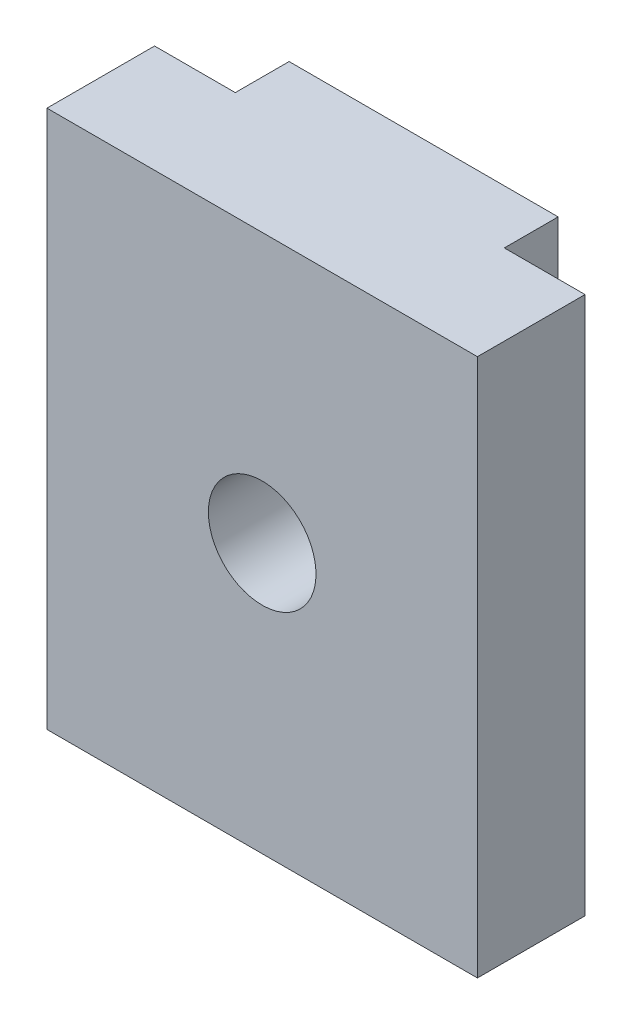
ISO-10303-21;
HEADER;
FILE_DESCRIPTION(('STEP AP214'),'2;1');
FILE_NAME('part.step','',(''),(''),'','','');
FILE_SCHEMA(('AUTOMOTIVE_DESIGN { 1 0 10303 214 1 1 1 1 }'));
ENDSEC;
DATA;
#1=APPLICATION_CONTEXT('core data for automotive mechanical design processes');
#2=APPLICATION_PROTOCOL_DEFINITION('international standard','automotive_design',2000,#1);
#3=PRODUCT_CONTEXT('',#1,'mechanical');
#4=PRODUCT('Part','Part','',(#3));
#5=PRODUCT_RELATED_PRODUCT_CATEGORY('part','',(#4));
#6=PRODUCT_DEFINITION_FORMATION('','',#4);
#7=PRODUCT_DEFINITION_CONTEXT('part definition',#1,'design');
#8=PRODUCT_DEFINITION('design','',#6,#7);
#9=PRODUCT_DEFINITION_SHAPE('','',#8);
#10=(LENGTH_UNIT() NAMED_UNIT(*) SI_UNIT(.MILLI.,.METRE.));
#11=(NAMED_UNIT(*) PLANE_ANGLE_UNIT() SI_UNIT($,.RADIAN.));
#12=(NAMED_UNIT(*) SI_UNIT($,.STERADIAN.) SOLID_ANGLE_UNIT());
#13=UNCERTAINTY_MEASURE_WITH_UNIT(LENGTH_MEASURE(1.E-05),#10,'distance_accuracy_value','');
#14=(GEOMETRIC_REPRESENTATION_CONTEXT(3) GLOBAL_UNCERTAINTY_ASSIGNED_CONTEXT((#13)) GLOBAL_UNIT_ASSIGNED_CONTEXT((#10,
#11,#12)) REPRESENTATION_CONTEXT('',''));
#15=CARTESIAN_POINT('',(0.,0.,0.));
#16=DIRECTION('',(0.,0.,1.));
#17=DIRECTION('',(1.,0.,0.));
#18=AXIS2_PLACEMENT_3D('',#15,#16,#17);
#19=CARTESIAN_POINT('',(7.99999999999999,20.,-2.));
#20=DIRECTION('',(-1.,0.,0.));
#21=DIRECTION('',(0.,0.,1.));
#22=AXIS2_PLACEMENT_3D('',#19,#20,#21);
#23=PLANE('',#22);
#24=DIRECTION('',(0.,0.,-1.));
#25=VECTOR('',#24,1.);
#26=CARTESIAN_POINT('',(7.99999999999999,0.,-2.));
#27=LINE('',#26,#25);
#28=CARTESIAN_POINT('',(7.99999999999999,0.,2.));
#29=VERTEX_POINT('',#28);
#30=CARTESIAN_POINT('',(7.99999999999999,0.,-2.));
#31=VERTEX_POINT('',#30);
#32=EDGE_CURVE('E128',#29,#31,#27,.T.);
#33=ORIENTED_EDGE('',*,*,#32,.T.);
#34=DIRECTION('',(0.,-1.,0.));
#35=VECTOR('',#34,1.);
#36=CARTESIAN_POINT('',(7.99999999999999,20.,-2.));
#37=LINE('',#36,#35);
#38=CARTESIAN_POINT('',(7.99999999999999,20.,-2.));
#39=VERTEX_POINT('',#38);
#40=EDGE_CURVE('E11',#39,#31,#37,.T.);
#41=ORIENTED_EDGE('',*,*,#40,.F.);
#42=DIRECTION('',(0.,0.,-1.));
#43=VECTOR('',#42,1.);
#44=CARTESIAN_POINT('',(7.99999999999999,20.,-2.));
#45=LINE('',#44,#43);
#46=CARTESIAN_POINT('',(7.99999999999999,20.,2.));
#47=VERTEX_POINT('',#46);
#48=EDGE_CURVE('E142',#47,#39,#45,.T.);
#49=ORIENTED_EDGE('',*,*,#48,.F.);
#50=DIRECTION('',(0.,-1.,0.));
#51=VECTOR('',#50,1.);
#52=CARTESIAN_POINT('',(7.99999999999999,20.,2.));
#53=LINE('',#52,#51);
#54=EDGE_CURVE('E124',#47,#29,#53,.T.);
#55=ORIENTED_EDGE('',*,*,#54,.T.);
#56=EDGE_LOOP('',(#33,#41,#49,#55));
#57=FACE_BOUND('',#56,.T.);
#58=ADVANCED_FACE('F31',(#57),#23,.F.);
#59=CARTESIAN_POINT('',(4.99999999999999,20.,-2.));
#60=DIRECTION('',(0.,0.,1.));
#61=DIRECTION('',(1.,0.,0.));
#62=AXIS2_PLACEMENT_3D('',#59,#60,#61);
#63=PLANE('',#62);
#64=DIRECTION('',(-1.,0.,0.));
#65=VECTOR('',#64,1.);
#66=CARTESIAN_POINT('',(4.99999999999999,0.,-2.));
#67=LINE('',#66,#65);
#68=CARTESIAN_POINT('',(4.99999999999999,0.,-2.));
#69=VERTEX_POINT('',#68);
#70=EDGE_CURVE('E131',#31,#69,#67,.T.);
#71=ORIENTED_EDGE('',*,*,#70,.T.);
#72=DIRECTION('',(0.,-1.,0.));
#73=VECTOR('',#72,1.);
#74=CARTESIAN_POINT('',(4.99999999999999,20.,-2.));
#75=LINE('',#74,#73);
#76=CARTESIAN_POINT('',(4.99999999999999,20.,-2.));
#77=VERTEX_POINT('',#76);
#78=EDGE_CURVE('E40',#77,#69,#75,.T.);
#79=ORIENTED_EDGE('',*,*,#78,.F.);
#80=DIRECTION('',(-1.,0.,0.));
#81=VECTOR('',#80,1.);
#82=CARTESIAN_POINT('',(4.99999999999999,20.,-2.));
#83=LINE('',#82,#81);
#84=EDGE_CURVE('E91',#39,#77,#83,.T.);
#85=ORIENTED_EDGE('',*,*,#84,.F.);
#86=ORIENTED_EDGE('',*,*,#40,.T.);
#87=EDGE_LOOP('',(#71,#79,#85,#86));
#88=FACE_BOUND('',#87,.T.);
#89=ADVANCED_FACE('F194',(#88),#63,.F.);
#90=CARTESIAN_POINT('',(4.99999999999999,20.,-2.));
#91=DIRECTION('',(-1.,0.,0.));
#92=DIRECTION('',(0.,0.,1.));
#93=AXIS2_PLACEMENT_3D('',#90,#91,#92);
#94=PLANE('',#93);
#95=DIRECTION('',(0.,0.,-1.));
#96=VECTOR('',#95,1.);
#97=CARTESIAN_POINT('',(4.99999999999999,0.,-2.));
#98=LINE('',#97,#96);
#99=CARTESIAN_POINT('',(4.99999999999999,0.,-4.));
#100=VERTEX_POINT('',#99);
#101=EDGE_CURVE('E133',#69,#100,#98,.T.);
#102=ORIENTED_EDGE('',*,*,#101,.T.);
#103=DIRECTION('',(0.,-1.,0.));
#104=VECTOR('',#103,1.);
#105=CARTESIAN_POINT('',(4.99999999999999,20.,-4.));
#106=LINE('',#105,#104);
#107=CARTESIAN_POINT('',(4.99999999999999,20.,-4.));
#108=VERTEX_POINT('',#107);
#109=EDGE_CURVE('E149',#108,#100,#106,.T.);
#110=ORIENTED_EDGE('',*,*,#109,.F.);
#111=DIRECTION('',(0.,0.,-1.));
#112=VECTOR('',#111,1.);
#113=CARTESIAN_POINT('',(4.99999999999999,20.,-2.));
#114=LINE('',#113,#112);
#115=EDGE_CURVE('E158',#77,#108,#114,.T.);
#116=ORIENTED_EDGE('',*,*,#115,.F.);
#117=ORIENTED_EDGE('',*,*,#78,.T.);
#118=EDGE_LOOP('',(#102,#110,#116,#117));
#119=FACE_BOUND('',#118,.T.);
#120=ADVANCED_FACE('F156',(#119),#94,.F.);
#121=CARTESIAN_POINT('',(4.99999999999999,20.,-4.));
#122=DIRECTION('',(0.,0.,1.));
#123=DIRECTION('',(1.,0.,0.));
#124=AXIS2_PLACEMENT_3D('',#121,#122,#123);
#125=PLANE('',#124);
#126=CARTESIAN_POINT('',(0.,10.,-4.));
#127=DIRECTION('',(0.,0.,-1.));
#128=DIRECTION('',(-1.,0.,0.));
#129=AXIS2_PLACEMENT_3D('',#126,#127,#128);
#130=CIRCLE('',#129,2.);
#131=CARTESIAN_POINT('',(-2.00000000000001,10.,-4.));
#132=VERTEX_POINT('',#131);
#133=EDGE_CURVE('E176',#132,#132,#130,.T.);
#134=ORIENTED_EDGE('',*,*,#133,.F.);
#135=EDGE_LOOP('',(#134));
#136=FACE_BOUND('',#135,.T.);
#137=DIRECTION('',(-1.,0.,0.));
#138=VECTOR('',#137,1.);
#139=CARTESIAN_POINT('',(4.99999999999999,0.,-4.));
#140=LINE('',#139,#138);
#141=CARTESIAN_POINT('',(-5.00000000000001,0.,-4.));
#142=VERTEX_POINT('',#141);
#143=EDGE_CURVE('E135',#100,#142,#140,.T.);
#144=ORIENTED_EDGE('',*,*,#143,.T.);
#145=DIRECTION('',(0.,-1.,0.));
#146=VECTOR('',#145,1.);
#147=CARTESIAN_POINT('',(-5.00000000000001,20.,-4.));
#148=LINE('',#147,#146);
#149=CARTESIAN_POINT('',(-5.00000000000001,20.,-4.));
#150=VERTEX_POINT('',#149);
#151=EDGE_CURVE('E146',#150,#142,#148,.T.);
#152=ORIENTED_EDGE('',*,*,#151,.F.);
#153=DIRECTION('',(-1.,0.,0.));
#154=VECTOR('',#153,1.);
#155=CARTESIAN_POINT('',(4.99999999999999,20.,-4.));
#156=LINE('',#155,#154);
#157=EDGE_CURVE('E170',#108,#150,#156,.T.);
#158=ORIENTED_EDGE('',*,*,#157,.F.);
#159=ORIENTED_EDGE('',*,*,#109,.T.);
#160=EDGE_LOOP('',(#144,#152,#158,#159));
#161=FACE_BOUND('',#160,.T.);
#162=ADVANCED_FACE('F166',(#136,#161),#125,.F.);
#163=CARTESIAN_POINT('',(-5.00000000000001,20.,-2.));
#164=DIRECTION('',(1.,0.,0.));
#165=DIRECTION('',(0.,0.,-1.));
#166=AXIS2_PLACEMENT_3D('',#163,#164,#165);
#167=PLANE('',#166);
#168=DIRECTION('',(0.,0.,1.));
#169=VECTOR('',#168,1.);
#170=CARTESIAN_POINT('',(-5.00000000000001,0.,-2.));
#171=LINE('',#170,#169);
#172=CARTESIAN_POINT('',(-5.00000000000001,0.,-2.));
#173=VERTEX_POINT('',#172);
#174=EDGE_CURVE('E137',#142,#173,#171,.T.);
#175=ORIENTED_EDGE('',*,*,#174,.T.);
#176=DIRECTION('',(0.,-1.,0.));
#177=VECTOR('',#176,1.);
#178=CARTESIAN_POINT('',(-5.00000000000001,20.,-2.));
#179=LINE('',#178,#177);
#180=CARTESIAN_POINT('',(-5.00000000000001,20.,-2.));
#181=VERTEX_POINT('',#180);
#182=EDGE_CURVE('E119',#181,#173,#179,.T.);
#183=ORIENTED_EDGE('',*,*,#182,.F.);
#184=DIRECTION('',(0.,0.,1.));
#185=VECTOR('',#184,1.);
#186=CARTESIAN_POINT('',(-5.00000000000001,20.,-2.));
#187=LINE('',#186,#185);
#188=EDGE_CURVE('E110',#150,#181,#187,.T.);
#189=ORIENTED_EDGE('',*,*,#188,.F.);
#190=ORIENTED_EDGE('',*,*,#151,.T.);
#191=EDGE_LOOP('',(#175,#183,#189,#190));
#192=FACE_BOUND('',#191,.T.);
#193=ADVANCED_FACE('F169',(#192),#167,.F.);
#194=CARTESIAN_POINT('',(-8.00000000000001,20.,-2.));
#195=DIRECTION('',(0.,0.,1.));
#196=DIRECTION('',(1.,0.,0.));
#197=AXIS2_PLACEMENT_3D('',#194,#195,#196);
#198=PLANE('',#197);
#199=DIRECTION('',(-1.,0.,0.));
#200=VECTOR('',#199,1.);
#201=CARTESIAN_POINT('',(-8.00000000000001,0.,-2.));
#202=LINE('',#201,#200);
#203=CARTESIAN_POINT('',(-8.00000000000001,0.,-2.));
#204=VERTEX_POINT('',#203);
#205=EDGE_CURVE('E118',#173,#204,#202,.T.);
#206=ORIENTED_EDGE('',*,*,#205,.T.);
#207=DIRECTION('',(0.,-1.,0.));
#208=VECTOR('',#207,1.);
#209=CARTESIAN_POINT('',(-8.00000000000001,20.,-2.));
#210=LINE('',#209,#208);
#211=CARTESIAN_POINT('',(-8.00000000000001,20.,-2.));
#212=VERTEX_POINT('',#211);
#213=EDGE_CURVE('E115',#212,#204,#210,.T.);
#214=ORIENTED_EDGE('',*,*,#213,.F.);
#215=DIRECTION('',(-1.,0.,0.));
#216=VECTOR('',#215,1.);
#217=CARTESIAN_POINT('',(-8.00000000000001,20.,-2.));
#218=LINE('',#217,#216);
#219=EDGE_CURVE('E104',#181,#212,#218,.T.);
#220=ORIENTED_EDGE('',*,*,#219,.F.);
#221=ORIENTED_EDGE('',*,*,#182,.T.);
#222=EDGE_LOOP('',(#206,#214,#220,#221));
#223=FACE_BOUND('',#222,.T.);
#224=ADVANCED_FACE('F116',(#223),#198,.F.);
#225=CARTESIAN_POINT('',(-8.00000000000001,20.,-2.));
#226=DIRECTION('',(1.,0.,0.));
#227=DIRECTION('',(0.,0.,-1.));
#228=AXIS2_PLACEMENT_3D('',#225,#226,#227);
#229=PLANE('',#228);
#230=DIRECTION('',(0.,0.,1.));
#231=VECTOR('',#230,1.);
#232=CARTESIAN_POINT('',(-8.00000000000001,0.,-2.));
#233=LINE('',#232,#231);
#234=CARTESIAN_POINT('',(-8.00000000000001,0.,2.));
#235=VERTEX_POINT('',#234);
#236=EDGE_CURVE('E77',#204,#235,#233,.T.);
#237=ORIENTED_EDGE('',*,*,#236,.T.);
#238=DIRECTION('',(0.,-1.,0.));
#239=VECTOR('',#238,1.);
#240=CARTESIAN_POINT('',(-8.00000000000001,20.,2.));
#241=LINE('',#240,#239);
#242=CARTESIAN_POINT('',(-8.00000000000001,20.,2.));
#243=VERTEX_POINT('',#242);
#244=EDGE_CURVE('E120',#243,#235,#241,.T.);
#245=ORIENTED_EDGE('',*,*,#244,.F.);
#246=DIRECTION('',(0.,0.,1.));
#247=VECTOR('',#246,1.);
#248=CARTESIAN_POINT('',(-8.00000000000001,20.,-2.));
#249=LINE('',#248,#247);
#250=EDGE_CURVE('E108',#212,#243,#249,.T.);
#251=ORIENTED_EDGE('',*,*,#250,.F.);
#252=ORIENTED_EDGE('',*,*,#213,.T.);
#253=EDGE_LOOP('',(#237,#245,#251,#252));
#254=FACE_BOUND('',#253,.T.);
#255=ADVANCED_FACE('F122',(#254),#229,.F.);
#256=CARTESIAN_POINT('',(-8.00000000000001,20.,2.));
#257=DIRECTION('',(0.,0.,-1.));
#258=DIRECTION('',(-1.,0.,0.));
#259=AXIS2_PLACEMENT_3D('',#256,#257,#258);
#260=PLANE('',#259);
#261=CARTESIAN_POINT('',(0.,10.,2.));
#262=DIRECTION('',(0.,0.,-1.));
#263=DIRECTION('',(-1.,0.,0.));
#264=AXIS2_PLACEMENT_3D('',#261,#262,#263);
#265=CIRCLE('',#264,2.);
#266=CARTESIAN_POINT('',(-2.00000000000001,10.,2.));
#267=VERTEX_POINT('',#266);
#268=EDGE_CURVE('E34',#267,#267,#265,.T.);
#269=ORIENTED_EDGE('',*,*,#268,.T.);
#270=EDGE_LOOP('',(#269));
#271=FACE_BOUND('',#270,.T.);
#272=DIRECTION('',(1.,0.,0.));
#273=VECTOR('',#272,1.);
#274=CARTESIAN_POINT('',(-8.00000000000001,0.,2.));
#275=LINE('',#274,#273);
#276=EDGE_CURVE('E83',#235,#29,#275,.T.);
#277=ORIENTED_EDGE('',*,*,#276,.T.);
#278=ORIENTED_EDGE('',*,*,#54,.F.);
#279=DIRECTION('',(1.,0.,0.));
#280=VECTOR('',#279,1.);
#281=CARTESIAN_POINT('',(-8.00000000000001,20.,2.));
#282=LINE('',#281,#280);
#283=EDGE_CURVE('E48',#243,#47,#282,.T.);
#284=ORIENTED_EDGE('',*,*,#283,.F.);
#285=ORIENTED_EDGE('',*,*,#244,.T.);
#286=EDGE_LOOP('',(#277,#278,#284,#285));
#287=FACE_BOUND('',#286,.T.);
#288=ADVANCED_FACE('F183',(#271,#287),#260,.F.);
#289=CARTESIAN_POINT('',(7.99999999999999,20.,2.));
#290=DIRECTION('',(0.,1.,0.));
#291=DIRECTION('',(0.,0.,1.));
#292=AXIS2_PLACEMENT_3D('',#289,#290,#291);
#293=PLANE('',#292);
#294=ORIENTED_EDGE('',*,*,#48,.T.);
#295=ORIENTED_EDGE('',*,*,#84,.T.);
#296=ORIENTED_EDGE('',*,*,#115,.T.);
#297=ORIENTED_EDGE('',*,*,#157,.T.);
#298=ORIENTED_EDGE('',*,*,#188,.T.);
#299=ORIENTED_EDGE('',*,*,#219,.T.);
#300=ORIENTED_EDGE('',*,*,#250,.T.);
#301=ORIENTED_EDGE('',*,*,#283,.T.);
#302=EDGE_LOOP('',(#294,#295,#296,#297,#298,#299,#300,#301));
#303=FACE_BOUND('',#302,.T.);
#304=ADVANCED_FACE('F106',(#303),#293,.T.);
#305=CARTESIAN_POINT('',(7.99999999999999,0.,2.));
#306=DIRECTION('',(0.,1.,0.));
#307=DIRECTION('',(0.,0.,1.));
#308=AXIS2_PLACEMENT_3D('',#305,#306,#307);
#309=PLANE('',#308);
#310=ORIENTED_EDGE('',*,*,#32,.F.);
#311=ORIENTED_EDGE('',*,*,#276,.F.);
#312=ORIENTED_EDGE('',*,*,#236,.F.);
#313=ORIENTED_EDGE('',*,*,#205,.F.);
#314=ORIENTED_EDGE('',*,*,#174,.F.);
#315=ORIENTED_EDGE('',*,*,#143,.F.);
#316=ORIENTED_EDGE('',*,*,#101,.F.);
#317=ORIENTED_EDGE('',*,*,#70,.F.);
#318=EDGE_LOOP('',(#310,#311,#312,#313,#314,#315,#316,#317));
#319=FACE_BOUND('',#318,.T.);
#320=ADVANCED_FACE('F162',(#319),#309,.F.);
#321=CARTESIAN_POINT('',(0.,10.,16.));
#322=DIRECTION('',(0.,0.,-1.));
#323=DIRECTION('',(-1.,0.,0.));
#324=AXIS2_PLACEMENT_3D('',#321,#322,#323);
#325=CYLINDRICAL_SURFACE('',#324,2.);
#326=ORIENTED_EDGE('',*,*,#133,.T.);
#327=EDGE_LOOP('',(#326));
#328=FACE_BOUND('',#327,.T.);
#329=ORIENTED_EDGE('',*,*,#268,.F.);
#330=EDGE_LOOP('',(#329));
#331=FACE_BOUND('',#330,.T.);
#332=ADVANCED_FACE('F185',(#328,#331),#325,.F.);
#333=CLOSED_SHELL('',(#58,#89,#120,#162,#193,#224,#255,#288,#304,#320,#332));
#334=MANIFOLD_SOLID_BREP('B2',#333);
#335=ADVANCED_BREP_SHAPE_REPRESENTATION('',(#18,#334),#14);
#336=SHAPE_DEFINITION_REPRESENTATION(#9,#335);
ENDSEC;
END-ISO-10303-21;
